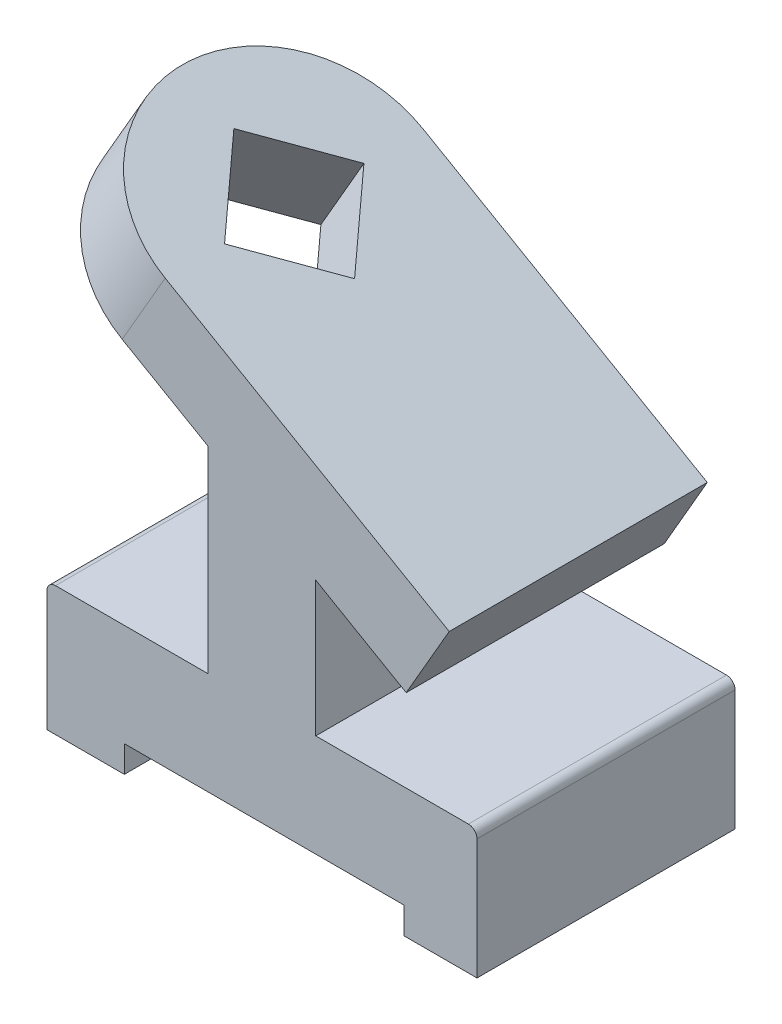
ISO-10303-21;
HEADER;
FILE_DESCRIPTION(('STEP AP214'),'2;1');
FILE_NAME('part.step','',(''),(''),'','','');
FILE_SCHEMA(('AUTOMOTIVE_DESIGN { 1 0 10303 214 1 1 1 1 }'));
ENDSEC;
DATA;
#1=APPLICATION_CONTEXT('core data for automotive mechanical design processes');
#2=APPLICATION_PROTOCOL_DEFINITION('international standard','automotive_design',2000,#1);
#3=PRODUCT_CONTEXT('',#1,'mechanical');
#4=PRODUCT('Part','Part','',(#3));
#5=PRODUCT_RELATED_PRODUCT_CATEGORY('part','',(#4));
#6=PRODUCT_DEFINITION_FORMATION('','',#4);
#7=PRODUCT_DEFINITION_CONTEXT('part definition',#1,'design');
#8=PRODUCT_DEFINITION('design','',#6,#7);
#9=PRODUCT_DEFINITION_SHAPE('','',#8);
#10=(LENGTH_UNIT() NAMED_UNIT(*) SI_UNIT(.MILLI.,.METRE.));
#11=(NAMED_UNIT(*) PLANE_ANGLE_UNIT() SI_UNIT($,.RADIAN.));
#12=(NAMED_UNIT(*) SI_UNIT($,.STERADIAN.) SOLID_ANGLE_UNIT());
#13=UNCERTAINTY_MEASURE_WITH_UNIT(LENGTH_MEASURE(1.E-05),#10,'distance_accuracy_value','');
#14=(GEOMETRIC_REPRESENTATION_CONTEXT(3) GLOBAL_UNCERTAINTY_ASSIGNED_CONTEXT((#13)) GLOBAL_UNIT_ASSIGNED_CONTEXT((#10,
#11,#12)) REPRESENTATION_CONTEXT('',''));
#15=CARTESIAN_POINT('',(0.,0.,0.));
#16=DIRECTION('',(0.,0.,1.));
#17=DIRECTION('',(1.,0.,0.));
#18=AXIS2_PLACEMENT_3D('',#15,#16,#17);
#19=CARTESIAN_POINT('',(-55.8324862973111,72.8306968374165,-38.1));
#20=DIRECTION('',(-0.5,-0.866025403784439,0.));
#21=DIRECTION('',(0.866025403784439,-0.5,0.));
#22=AXIS2_PLACEMENT_3D('',#19,#20,#21);
#23=PLANE('',#22);
#24=DIRECTION('',(0.,0.,1.));
#25=VECTOR('',#24,1.);
#26=CARTESIAN_POINT('',(-30.4324862973111,58.166,-38.1));
#27=LINE('',#26,#25);
#28=CARTESIAN_POINT('',(-30.432486297311,58.166,-38.1));
#29=VERTEX_POINT('',#28);
#30=CARTESIAN_POINT('',(-30.432486297311,58.166,38.1));
#31=VERTEX_POINT('',#30);
#32=EDGE_CURVE('E317',#29,#31,#27,.T.);
#33=ORIENTED_EDGE('',*,*,#32,.T.);
#34=DIRECTION('',(0.866025403784439,-0.5,0.));
#35=VECTOR('',#34,1.);
#36=CARTESIAN_POINT('',(-55.8324862973111,72.8306968374165,38.1));
#37=LINE('',#36,#35);
#38=CARTESIAN_POINT('',(-55.8324862973111,72.8306968374166,38.1));
#39=VERTEX_POINT('',#38);
#40=EDGE_CURVE('E216',#39,#31,#37,.T.);
#41=ORIENTED_EDGE('',*,*,#40,.F.);
#42=CARTESIAN_POINT('',(-55.8324862973111,72.8306968374166,0.));
#43=DIRECTION('',(0.5,0.866025403784439,0.));
#44=DIRECTION('',(-0.866025403784439,0.5,0.));
#45=AXIS2_PLACEMENT_3D('',#42,#43,#44);
#46=CIRCLE('',#45,38.1);
#47=CARTESIAN_POINT('',(-55.8324862973111,72.8306968374166,-38.1));
#48=VERTEX_POINT('',#47);
#49=EDGE_CURVE('E208',#48,#39,#46,.T.);
#50=ORIENTED_EDGE('',*,*,#49,.F.);
#51=DIRECTION('',(0.866025403784439,-0.5,0.));
#52=VECTOR('',#51,1.);
#53=CARTESIAN_POINT('',(-55.8324862973111,72.8306968374165,-38.1));
#54=LINE('',#53,#52);
#55=EDGE_CURVE('E222',#48,#29,#54,.T.);
#56=ORIENTED_EDGE('',*,*,#55,.T.);
#57=EDGE_LOOP('',(#33,#41,#50,#56));
#58=FACE_BOUND('',#57,.T.);
#59=DIRECTION('',(-0.612372435695794,0.353553390593273,-0.707106781186548));
#60=VECTOR('',#59,1.);
#61=CARTESIAN_POINT('',(-38.01487963985,62.5436968374166,0.));
#62=LINE('',#61,#60);
#63=CARTESIAN_POINT('',(-38.01487963985,62.5436968374166,0.));
#64=VERTEX_POINT('',#63);
#65=CARTESIAN_POINT('',(-55.8324862973111,72.8306968374165,-20.574));
#66=VERTEX_POINT('',#65);
#67=EDGE_CURVE('E199',#64,#66,#62,.T.);
#68=ORIENTED_EDGE('',*,*,#67,.T.);
#69=DIRECTION('',(-0.612372435695795,0.353553390593274,0.707106781186547));
#70=VECTOR('',#69,1.);
#71=CARTESIAN_POINT('',(-55.8324862973111,72.8306968374166,-20.574));
#72=LINE('',#71,#70);
#73=CARTESIAN_POINT('',(-73.6500929547721,83.1176968374166,0.));
#74=VERTEX_POINT('',#73);
#75=EDGE_CURVE('E48',#66,#74,#72,.T.);
#76=ORIENTED_EDGE('',*,*,#75,.T.);
#77=DIRECTION('',(0.612372435695795,-0.353553390593274,0.707106781186547));
#78=VECTOR('',#77,1.);
#79=CARTESIAN_POINT('',(-73.6500929547721,83.1176968374166,0.));
#80=LINE('',#79,#78);
#81=CARTESIAN_POINT('',(-55.8324862973111,72.8306968374166,20.574));
#82=VERTEX_POINT('',#81);
#83=EDGE_CURVE('E190',#74,#82,#80,.T.);
#84=ORIENTED_EDGE('',*,*,#83,.T.);
#85=DIRECTION('',(0.612372435695794,-0.353553390593274,-0.707106781186548));
#86=VECTOR('',#85,1.);
#87=CARTESIAN_POINT('',(-55.8324862973111,72.8306968374166,20.574));
#88=LINE('',#87,#86);
#89=EDGE_CURVE('E196',#82,#64,#88,.T.);
#90=ORIENTED_EDGE('',*,*,#89,.T.);
#91=EDGE_LOOP('',(#68,#76,#84,#90));
#92=FACE_BOUND('',#91,.T.);
#93=ADVANCED_FACE('F33',(#58,#92),#23,.T.);
#94=CARTESIAN_POINT('',(-43.1324862973111,94.8277420935413,-38.1));
#95=DIRECTION('',(0.5,0.866025403784439,0.));
#96=DIRECTION('',(-0.866025403784439,0.5,0.));
#97=AXIS2_PLACEMENT_3D('',#94,#95,#96);
#98=PLANE('',#97);
#99=DIRECTION('',(-0.866025403784439,0.5,0.));
#100=VECTOR('',#99,1.);
#101=CARTESIAN_POINT('',(-43.1324862973111,94.8277420935413,-38.1));
#102=LINE('',#101,#100);
#103=CARTESIAN_POINT('',(40.7312487416645,46.4089920935413,-38.1));
#104=VERTEX_POINT('',#103);
#105=CARTESIAN_POINT('',(-43.1324862973111,94.8277420935413,-38.1));
#106=VERTEX_POINT('',#105);
#107=EDGE_CURVE('E215',#104,#106,#102,.T.);
#108=ORIENTED_EDGE('',*,*,#107,.T.);
#109=CARTESIAN_POINT('',(-43.1324862973111,94.8277420935413,0.));
#110=DIRECTION('',(0.5,0.866025403784439,0.));
#111=DIRECTION('',(-0.866025403784439,0.5,0.));
#112=AXIS2_PLACEMENT_3D('',#109,#110,#111);
#113=CIRCLE('',#112,38.1);
#114=CARTESIAN_POINT('',(-43.1324862973111,94.8277420935413,38.1));
#115=VERTEX_POINT('',#114);
#116=EDGE_CURVE('E186',#106,#115,#113,.T.);
#117=ORIENTED_EDGE('',*,*,#116,.T.);
#118=DIRECTION('',(-0.866025403784439,0.5,0.));
#119=VECTOR('',#118,1.);
#120=CARTESIAN_POINT('',(-43.1324862973111,94.8277420935413,38.1));
#121=LINE('',#120,#119);
#122=CARTESIAN_POINT('',(40.7312487416645,46.4089920935413,38.1));
#123=VERTEX_POINT('',#122);
#124=EDGE_CURVE('E227',#123,#115,#121,.T.);
#125=ORIENTED_EDGE('',*,*,#124,.F.);
#126=DIRECTION('',(0.,0.,1.));
#127=VECTOR('',#126,1.);
#128=CARTESIAN_POINT('',(40.7312487416645,46.4089920935413,-38.1));
#129=LINE('',#128,#127);
#130=EDGE_CURVE('E224',#104,#123,#129,.T.);
#131=ORIENTED_EDGE('',*,*,#130,.F.);
#132=EDGE_LOOP('',(#108,#117,#125,#131));
#133=FACE_BOUND('',#132,.T.);
#134=DIRECTION('',(-0.612372435695795,0.353553390593274,-0.707106781186547));
#135=VECTOR('',#134,1.);
#136=CARTESIAN_POINT('',(-68.5390735681352,109.496242093541,-8.76299999999999));
#137=LINE('',#136,#135);
#138=CARTESIAN_POINT('',(-43.1324862973111,94.8277420935413,20.574));
#139=VERTEX_POINT('',#138);
#140=CARTESIAN_POINT('',(-60.9500929547721,105.114742093541,0.));
#141=VERTEX_POINT('',#140);
#142=EDGE_CURVE('E41',#139,#141,#137,.T.);
#143=ORIENTED_EDGE('',*,*,#142,.T.);
#144=DIRECTION('',(0.612372435695795,-0.353553390593274,-0.707106781186547));
#145=VECTOR('',#144,1.);
#146=CARTESIAN_POINT('',(-35.5435056839481,90.4462420935413,-29.337));
#147=LINE('',#146,#145);
#148=CARTESIAN_POINT('',(-43.1324862973111,94.8277420935413,-20.574));
#149=VERTEX_POINT('',#148);
#150=EDGE_CURVE('E11',#141,#149,#147,.T.);
#151=ORIENTED_EDGE('',*,*,#150,.T.);
#152=DIRECTION('',(0.612372435695794,-0.353553390593273,0.707106781186548));
#153=VECTOR('',#152,1.);
#154=CARTESIAN_POINT('',(-50.7214669106741,99.2092420935413,-29.337));
#155=LINE('',#154,#153);
#156=CARTESIAN_POINT('',(-25.3148796398501,84.5407420935413,0.));
#157=VERTEX_POINT('',#156);
#158=EDGE_CURVE('E342',#149,#157,#155,.T.);
#159=ORIENTED_EDGE('',*,*,#158,.T.);
#160=DIRECTION('',(-0.612372435695794,0.353553390593273,0.707106781186548));
#161=VECTOR('',#160,1.);
#162=CARTESIAN_POINT('',(-17.725899026487,80.1592420935413,-8.76300000000004));
#163=LINE('',#162,#161);
#164=EDGE_CURVE('E345',#157,#139,#163,.T.);
#165=ORIENTED_EDGE('',*,*,#164,.T.);
#166=EDGE_LOOP('',(#143,#151,#159,#165));
#167=FACE_BOUND('',#166,.T.);
#168=ADVANCED_FACE('F348',(#133,#167),#98,.T.);
#169=CARTESIAN_POINT('',(27.3525137026889,-30.2363051563377,-38.1));
#170=DIRECTION('',(-1.,0.,0.));
#171=DIRECTION('',(0.,-1.,0.));
#172=AXIS2_PLACEMENT_3D('',#169,#170,#171);
#173=PLANE('',#172);
#174=DIRECTION('',(0.,0.,1.));
#175=VECTOR('',#174,1.);
#176=CARTESIAN_POINT('',(27.3525137026889,-38.1,-38.1));
#177=LINE('',#176,#175);
#178=CARTESIAN_POINT('',(27.3525137026889,-38.1,-38.1));
#179=VERTEX_POINT('',#178);
#180=CARTESIAN_POINT('',(27.3525137026889,-38.1,38.1));
#181=VERTEX_POINT('',#180);
#182=EDGE_CURVE('E304',#179,#181,#177,.T.);
#183=ORIENTED_EDGE('',*,*,#182,.T.);
#184=DIRECTION('',(0.,-1.,0.));
#185=VECTOR('',#184,1.);
#186=CARTESIAN_POINT('',(27.3525137026889,-30.2363051563377,38.1));
#187=LINE('',#186,#185);
#188=CARTESIAN_POINT('',(27.3525137026889,-30.2363051563377,38.1));
#189=VERTEX_POINT('',#188);
#190=EDGE_CURVE('E242',#189,#181,#187,.T.);
#191=ORIENTED_EDGE('',*,*,#190,.F.);
#192=DIRECTION('',(0.,0.,1.));
#193=VECTOR('',#192,1.);
#194=CARTESIAN_POINT('',(27.3525137026889,-30.2363051563377,-38.1));
#195=LINE('',#194,#193);
#196=CARTESIAN_POINT('',(27.3525137026889,-30.2363051563377,-38.1));
#197=VERTEX_POINT('',#196);
#198=EDGE_CURVE('E305',#197,#189,#195,.T.);
#199=ORIENTED_EDGE('',*,*,#198,.F.);
#200=DIRECTION('',(0.,-1.,0.));
#201=VECTOR('',#200,1.);
#202=CARTESIAN_POINT('',(27.3525137026889,-30.2363051563377,-38.1));
#203=LINE('',#202,#201);
#204=EDGE_CURVE('E273',#197,#179,#203,.T.);
#205=ORIENTED_EDGE('',*,*,#204,.T.);
#206=EDGE_LOOP('',(#183,#191,#199,#205));
#207=FACE_BOUND('',#206,.T.);
#208=ADVANCED_FACE('F366',(#207),#173,.T.);
#209=CARTESIAN_POINT('',(-55.1974862973111,-30.2363051563377,-38.1));
#210=DIRECTION('',(0.,-1.,0.));
#211=DIRECTION('',(0.,0.,-1.));
#212=AXIS2_PLACEMENT_3D('',#209,#210,#211);
#213=PLANE('',#212);
#214=ORIENTED_EDGE('',*,*,#198,.T.);
#215=DIRECTION('',(1.,0.,0.));
#216=VECTOR('',#215,1.);
#217=CARTESIAN_POINT('',(-55.1974862973111,-30.2363051563377,38.1));
#218=LINE('',#217,#216);
#219=CARTESIAN_POINT('',(-55.1974862973111,-30.2363051563377,38.1));
#220=VERTEX_POINT('',#219);
#221=EDGE_CURVE('E270',#220,#189,#218,.T.);
#222=ORIENTED_EDGE('',*,*,#221,.F.);
#223=DIRECTION('',(0.,0.,1.));
#224=VECTOR('',#223,1.);
#225=CARTESIAN_POINT('',(-55.1974862973111,-30.2363051563377,-38.1));
#226=LINE('',#225,#224);
#227=CARTESIAN_POINT('',(-55.1974862973111,-30.2363051563377,-38.1));
#228=VERTEX_POINT('',#227);
#229=EDGE_CURVE('E308',#228,#220,#226,.T.);
#230=ORIENTED_EDGE('',*,*,#229,.F.);
#231=DIRECTION('',(1.,0.,0.));
#232=VECTOR('',#231,1.);
#233=CARTESIAN_POINT('',(-55.1974862973111,-30.2363051563377,-38.1));
#234=LINE('',#233,#232);
#235=EDGE_CURVE('E301',#228,#197,#234,.T.);
#236=ORIENTED_EDGE('',*,*,#235,.T.);
#237=EDGE_LOOP('',(#214,#222,#230,#236));
#238=FACE_BOUND('',#237,.T.);
#239=ADVANCED_FACE('F437',(#238),#213,.T.);
#240=CARTESIAN_POINT('',(-55.1974862973111,-38.1,-38.1));
#241=DIRECTION('',(1.,0.,0.));
#242=DIRECTION('',(0.,0.,-1.));
#243=AXIS2_PLACEMENT_3D('',#240,#241,#242);
#244=PLANE('',#243);
#245=ORIENTED_EDGE('',*,*,#229,.T.);
#246=DIRECTION('',(0.,1.,0.));
#247=VECTOR('',#246,1.);
#248=CARTESIAN_POINT('',(-55.1974862973111,-38.1,38.1));
#249=LINE('',#248,#247);
#250=CARTESIAN_POINT('',(-55.1974862973111,-38.1,38.1));
#251=VERTEX_POINT('',#250);
#252=EDGE_CURVE('E267',#251,#220,#249,.T.);
#253=ORIENTED_EDGE('',*,*,#252,.F.);
#254=DIRECTION('',(0.,0.,1.));
#255=VECTOR('',#254,1.);
#256=CARTESIAN_POINT('',(-55.1974862973111,-38.1,-38.1));
#257=LINE('',#256,#255);
#258=CARTESIAN_POINT('',(-55.1974862973111,-38.1,-38.1));
#259=VERTEX_POINT('',#258);
#260=EDGE_CURVE('E310',#259,#251,#257,.T.);
#261=ORIENTED_EDGE('',*,*,#260,.F.);
#262=DIRECTION('',(0.,1.,0.));
#263=VECTOR('',#262,1.);
#264=CARTESIAN_POINT('',(-55.1974862973111,-38.1,-38.1));
#265=LINE('',#264,#263);
#266=EDGE_CURVE('E298',#259,#228,#265,.T.);
#267=ORIENTED_EDGE('',*,*,#266,.T.);
#268=EDGE_LOOP('',(#245,#253,#261,#267));
#269=FACE_BOUND('',#268,.T.);
#270=ADVANCED_FACE('F433',(#269),#244,.T.);
#271=CARTESIAN_POINT('',(-78.0574862973111,-38.1,-38.1));
#272=DIRECTION('',(0.,-1.,0.));
#273=DIRECTION('',(1.,0.,0.));
#274=AXIS2_PLACEMENT_3D('',#271,#272,#273);
#275=PLANE('',#274);
#276=ORIENTED_EDGE('',*,*,#260,.T.);
#277=DIRECTION('',(1.,0.,0.));
#278=VECTOR('',#277,1.);
#279=CARTESIAN_POINT('',(-78.0574862973111,-38.1,38.1));
#280=LINE('',#279,#278);
#281=CARTESIAN_POINT('',(-78.0574862973111,-38.1,38.1));
#282=VERTEX_POINT('',#281);
#283=EDGE_CURVE('E264',#282,#251,#280,.T.);
#284=ORIENTED_EDGE('',*,*,#283,.F.);
#285=DIRECTION('',(0.,0.,1.));
#286=VECTOR('',#285,1.);
#287=CARTESIAN_POINT('',(-78.0574862973111,-38.1,-38.1));
#288=LINE('',#287,#286);
#289=CARTESIAN_POINT('',(-78.0574862973111,-38.1,-38.1));
#290=VERTEX_POINT('',#289);
#291=EDGE_CURVE('E312',#290,#282,#288,.T.);
#292=ORIENTED_EDGE('',*,*,#291,.F.);
#293=DIRECTION('',(1.,0.,0.));
#294=VECTOR('',#293,1.);
#295=CARTESIAN_POINT('',(-78.0574862973111,-38.1,-38.1));
#296=LINE('',#295,#294);
#297=EDGE_CURVE('E295',#290,#259,#296,.T.);
#298=ORIENTED_EDGE('',*,*,#297,.T.);
#299=EDGE_LOOP('',(#276,#284,#292,#298));
#300=FACE_BOUND('',#299,.T.);
#301=ADVANCED_FACE('F429',(#300),#275,.T.);
#302=CARTESIAN_POINT('',(-78.0574862973111,0.,-38.1));
#303=DIRECTION('',(-1.,0.,0.));
#304=DIRECTION('',(0.,0.,1.));
#305=AXIS2_PLACEMENT_3D('',#302,#303,#304);
#306=PLANE('',#305);
#307=DIRECTION('',(0.,-1.,0.));
#308=VECTOR('',#307,1.);
#309=CARTESIAN_POINT('',(-78.0574862973111,0.,38.1));
#310=LINE('',#309,#308);
#311=CARTESIAN_POINT('',(-78.0574862973111,-2.54,38.1));
#312=VERTEX_POINT('',#311);
#313=EDGE_CURVE('E262',#312,#282,#310,.T.);
#314=ORIENTED_EDGE('',*,*,#313,.F.);
#315=DIRECTION('',(0.,0.,1.));
#316=VECTOR('',#315,1.);
#317=CARTESIAN_POINT('',(-78.0574862973111,-2.54,-38.1));
#318=LINE('',#317,#316);
#319=CARTESIAN_POINT('',(-78.0574862973111,-2.54,-38.1));
#320=VERTEX_POINT('',#319);
#321=EDGE_CURVE('E338',#312,#320,#318,.F.);
#322=ORIENTED_EDGE('',*,*,#321,.T.);
#323=DIRECTION('',(0.,-1.,0.));
#324=VECTOR('',#323,1.);
#325=CARTESIAN_POINT('',(-78.0574862973111,0.,-38.1));
#326=LINE('',#325,#324);
#327=EDGE_CURVE('E293',#320,#290,#326,.T.);
#328=ORIENTED_EDGE('',*,*,#327,.T.);
#329=ORIENTED_EDGE('',*,*,#291,.T.);
#330=EDGE_LOOP('',(#314,#322,#328,#329));
#331=FACE_BOUND('',#330,.T.);
#332=ADVANCED_FACE('F423',(#331),#306,.T.);
#333=CARTESIAN_POINT('',(-78.0574862973111,0.,-38.1));
#334=DIRECTION('',(0.,1.,0.));
#335=DIRECTION('',(0.,0.,1.));
#336=AXIS2_PLACEMENT_3D('',#333,#334,#335);
#337=PLANE('',#336);
#338=DIRECTION('',(-1.,0.,0.));
#339=VECTOR('',#338,1.);
#340=CARTESIAN_POINT('',(-78.0574862973111,0.,-38.1));
#341=LINE('',#340,#339);
#342=CARTESIAN_POINT('',(-30.4324862973111,0.,-38.1));
#343=VERTEX_POINT('',#342);
#344=CARTESIAN_POINT('',(-75.5174862973111,0.,-38.1));
#345=VERTEX_POINT('',#344);
#346=EDGE_CURVE('E290',#343,#345,#341,.T.);
#347=ORIENTED_EDGE('',*,*,#346,.T.);
#348=DIRECTION('',(0.,0.,1.));
#349=VECTOR('',#348,1.);
#350=CARTESIAN_POINT('',(-75.5174862973111,0.,-38.1));
#351=LINE('',#350,#349);
#352=CARTESIAN_POINT('',(-75.5174862973111,0.,38.1));
#353=VERTEX_POINT('',#352);
#354=EDGE_CURVE('E333',#345,#353,#351,.T.);
#355=ORIENTED_EDGE('',*,*,#354,.T.);
#356=DIRECTION('',(-1.,0.,0.));
#357=VECTOR('',#356,1.);
#358=CARTESIAN_POINT('',(-78.0574862973111,0.,38.1));
#359=LINE('',#358,#357);
#360=CARTESIAN_POINT('',(-30.4324862973111,0.,38.1));
#361=VERTEX_POINT('',#360);
#362=EDGE_CURVE('E259',#361,#353,#359,.T.);
#363=ORIENTED_EDGE('',*,*,#362,.F.);
#364=DIRECTION('',(0.,0.,1.));
#365=VECTOR('',#364,1.);
#366=CARTESIAN_POINT('',(-30.4324862973111,0.,-38.1));
#367=LINE('',#366,#365);
#368=EDGE_CURVE('E315',#343,#361,#367,.T.);
#369=ORIENTED_EDGE('',*,*,#368,.F.);
#370=EDGE_LOOP('',(#347,#355,#363,#369));
#371=FACE_BOUND('',#370,.T.);
#372=ADVANCED_FACE('F416',(#371),#337,.T.);
#373=CARTESIAN_POINT('',(-30.4324862973111,0.,-38.1));
#374=DIRECTION('',(-1.,0.,0.));
#375=DIRECTION('',(0.,0.,1.));
#376=AXIS2_PLACEMENT_3D('',#373,#374,#375);
#377=PLANE('',#376);
#378=ORIENTED_EDGE('',*,*,#368,.T.);
#379=DIRECTION('',(0.,-1.,0.));
#380=VECTOR('',#379,1.);
#381=CARTESIAN_POINT('',(-30.4324862973111,0.,38.1));
#382=LINE('',#381,#380);
#383=EDGE_CURVE('E256',#31,#361,#382,.T.);
#384=ORIENTED_EDGE('',*,*,#383,.F.);
#385=ORIENTED_EDGE('',*,*,#32,.F.);
#386=DIRECTION('',(0.,-1.,0.));
#387=VECTOR('',#386,1.);
#388=CARTESIAN_POINT('',(-30.4324862973111,0.,-38.1));
#389=LINE('',#388,#387);
#390=EDGE_CURVE('E287',#29,#343,#389,.T.);
#391=ORIENTED_EDGE('',*,*,#390,.T.);
#392=EDGE_LOOP('',(#378,#384,#385,#391));
#393=FACE_BOUND('',#392,.T.);
#394=ADVANCED_FACE('F412',(#393),#377,.T.);
#395=CARTESIAN_POINT('',(1.3175137026889,58.166,-38.1));
#396=DIRECTION('',(1.,0.,0.));
#397=DIRECTION('',(0.,1.,0.));
#398=AXIS2_PLACEMENT_3D('',#395,#396,#397);
#399=PLANE('',#398);
#400=DIRECTION('',(0.,0.,-1.));
#401=VECTOR('',#400,1.);
#402=CARTESIAN_POINT('',(1.3175137026889,39.8351289532294,-38.1));
#403=LINE('',#402,#401);
#404=CARTESIAN_POINT('',(1.31751370268889,39.8351289532295,38.1));
#405=VERTEX_POINT('',#404);
#406=CARTESIAN_POINT('',(1.31751370268889,39.8351289532295,-38.1));
#407=VERTEX_POINT('',#406);
#408=EDGE_CURVE('E239',#405,#407,#403,.T.);
#409=ORIENTED_EDGE('',*,*,#408,.F.);
#410=DIRECTION('',(0.,1.,0.));
#411=VECTOR('',#410,1.);
#412=CARTESIAN_POINT('',(1.3175137026889,58.166,38.1));
#413=LINE('',#412,#411);
#414=CARTESIAN_POINT('',(1.3175137026889,0.,38.1));
#415=VERTEX_POINT('',#414);
#416=EDGE_CURVE('E253',#415,#405,#413,.T.);
#417=ORIENTED_EDGE('',*,*,#416,.F.);
#418=DIRECTION('',(0.,0.,1.));
#419=VECTOR('',#418,1.);
#420=CARTESIAN_POINT('',(1.3175137026889,0.,-38.1));
#421=LINE('',#420,#419);
#422=CARTESIAN_POINT('',(1.3175137026889,0.,-38.1));
#423=VERTEX_POINT('',#422);
#424=EDGE_CURVE('E319',#423,#415,#421,.T.);
#425=ORIENTED_EDGE('',*,*,#424,.F.);
#426=DIRECTION('',(0.,1.,0.));
#427=VECTOR('',#426,1.);
#428=CARTESIAN_POINT('',(1.3175137026889,58.166,-38.1));
#429=LINE('',#428,#427);
#430=EDGE_CURVE('E284',#423,#407,#429,.T.);
#431=ORIENTED_EDGE('',*,*,#430,.T.);
#432=EDGE_LOOP('',(#409,#417,#425,#431));
#433=FACE_BOUND('',#432,.T.);
#434=ADVANCED_FACE('F388',(#433),#399,.T.);
#435=CARTESIAN_POINT('',(1.3175137026889,0.,-38.1));
#436=DIRECTION('',(0.,1.,0.));
#437=DIRECTION('',(0.,0.,1.));
#438=AXIS2_PLACEMENT_3D('',#435,#436,#437);
#439=PLANE('',#438);
#440=DIRECTION('',(-1.,0.,0.));
#441=VECTOR('',#440,1.);
#442=CARTESIAN_POINT('',(1.3175137026889,0.,38.1));
#443=LINE('',#442,#441);
#444=CARTESIAN_POINT('',(46.4025137026889,0.,38.1));
#445=VERTEX_POINT('',#444);
#446=EDGE_CURVE('E251',#445,#415,#443,.T.);
#447=ORIENTED_EDGE('',*,*,#446,.F.);
#448=DIRECTION('',(0.,0.,1.));
#449=VECTOR('',#448,1.);
#450=CARTESIAN_POINT('',(46.4025137026889,0.,-38.1));
#451=LINE('',#450,#449);
#452=CARTESIAN_POINT('',(46.4025137026889,0.,-38.1));
#453=VERTEX_POINT('',#452);
#454=EDGE_CURVE('E329',#445,#453,#451,.F.);
#455=ORIENTED_EDGE('',*,*,#454,.T.);
#456=DIRECTION('',(-1.,0.,0.));
#457=VECTOR('',#456,1.);
#458=CARTESIAN_POINT('',(1.3175137026889,0.,-38.1));
#459=LINE('',#458,#457);
#460=EDGE_CURVE('E282',#453,#423,#459,.T.);
#461=ORIENTED_EDGE('',*,*,#460,.T.);
#462=ORIENTED_EDGE('',*,*,#424,.T.);
#463=EDGE_LOOP('',(#447,#455,#461,#462));
#464=FACE_BOUND('',#463,.T.);
#465=ADVANCED_FACE('F395',(#464),#439,.T.);
#466=CARTESIAN_POINT('',(48.9425137026889,0.,-38.1));
#467=DIRECTION('',(1.,0.,0.));
#468=DIRECTION('',(0.,1.,0.));
#469=AXIS2_PLACEMENT_3D('',#466,#467,#468);
#470=PLANE('',#469);
#471=DIRECTION('',(0.,1.,0.));
#472=VECTOR('',#471,1.);
#473=CARTESIAN_POINT('',(48.9425137026889,0.,-38.1));
#474=LINE('',#473,#472);
#475=CARTESIAN_POINT('',(48.9425137026889,-38.1,-38.1));
#476=VERTEX_POINT('',#475);
#477=CARTESIAN_POINT('',(48.9425137026889,-2.54,-38.1));
#478=VERTEX_POINT('',#477);
#479=EDGE_CURVE('E279',#476,#478,#474,.T.);
#480=ORIENTED_EDGE('',*,*,#479,.T.);
#481=DIRECTION('',(0.,0.,1.));
#482=VECTOR('',#481,1.);
#483=CARTESIAN_POINT('',(48.9425137026889,-2.54,-38.1));
#484=LINE('',#483,#482);
#485=CARTESIAN_POINT('',(48.9425137026889,-2.54,38.1));
#486=VERTEX_POINT('',#485);
#487=EDGE_CURVE('E307',#478,#486,#484,.T.);
#488=ORIENTED_EDGE('',*,*,#487,.T.);
#489=DIRECTION('',(0.,1.,0.));
#490=VECTOR('',#489,1.);
#491=CARTESIAN_POINT('',(48.9425137026889,0.,38.1));
#492=LINE('',#491,#490);
#493=CARTESIAN_POINT('',(48.9425137026889,-38.1,38.1));
#494=VERTEX_POINT('',#493);
#495=EDGE_CURVE('E248',#494,#486,#492,.T.);
#496=ORIENTED_EDGE('',*,*,#495,.F.);
#497=DIRECTION('',(0.,0.,1.));
#498=VECTOR('',#497,1.);
#499=CARTESIAN_POINT('',(48.9425137026889,-38.1,-38.1));
#500=LINE('',#499,#498);
#501=EDGE_CURVE('E322',#476,#494,#500,.T.);
#502=ORIENTED_EDGE('',*,*,#501,.F.);
#503=EDGE_LOOP('',(#480,#488,#496,#502));
#504=FACE_BOUND('',#503,.T.);
#505=ADVANCED_FACE('F447',(#504),#470,.T.);
#506=CARTESIAN_POINT('',(27.3525137026889,-38.1,-38.1));
#507=DIRECTION('',(0.,-1.,0.));
#508=DIRECTION('',(1.,0.,0.));
#509=AXIS2_PLACEMENT_3D('',#506,#507,#508);
#510=PLANE('',#509);
#511=ORIENTED_EDGE('',*,*,#501,.T.);
#512=DIRECTION('',(1.,0.,0.));
#513=VECTOR('',#512,1.);
#514=CARTESIAN_POINT('',(27.3525137026889,-38.1,38.1));
#515=LINE('',#514,#513);
#516=EDGE_CURVE('E245',#181,#494,#515,.T.);
#517=ORIENTED_EDGE('',*,*,#516,.F.);
#518=ORIENTED_EDGE('',*,*,#182,.F.);
#519=DIRECTION('',(1.,0.,0.));
#520=VECTOR('',#519,1.);
#521=CARTESIAN_POINT('',(27.3525137026889,-38.1,-38.1));
#522=LINE('',#521,#520);
#523=EDGE_CURVE('E276',#179,#476,#522,.T.);
#524=ORIENTED_EDGE('',*,*,#523,.T.);
#525=EDGE_LOOP('',(#511,#517,#518,#524));
#526=FACE_BOUND('',#525,.T.);
#527=ADVANCED_FACE('F444',(#526),#510,.T.);
#528=CARTESIAN_POINT('',(0.,0.,-38.1));
#529=DIRECTION('',(0.,0.,1.));
#530=DIRECTION('',(1.,0.,0.));
#531=AXIS2_PLACEMENT_3D('',#528,#529,#530);
#532=PLANE('',#531);
#533=ORIENTED_EDGE('',*,*,#390,.F.);
#534=ORIENTED_EDGE('',*,*,#55,.F.);
#535=DIRECTION('',(-0.5,-0.866025403784439,0.));
#536=VECTOR('',#535,1.);
#537=CARTESIAN_POINT('',(-55.8324862973111,72.8306968374165,-38.1));
#538=LINE('',#537,#536);
#539=EDGE_CURVE('E219',#106,#48,#538,.T.);
#540=ORIENTED_EDGE('',*,*,#539,.F.);
#541=ORIENTED_EDGE('',*,*,#107,.F.);
#542=DIRECTION('',(0.5,0.866025403784439,0.));
#543=VECTOR('',#542,1.);
#544=CARTESIAN_POINT('',(40.7312487416645,46.4089920935413,-38.1));
#545=LINE('',#544,#543);
#546=CARTESIAN_POINT('',(28.0312487416645,24.4119468374165,-38.1));
#547=VERTEX_POINT('',#546);
#548=EDGE_CURVE('E212',#547,#104,#545,.T.);
#549=ORIENTED_EDGE('',*,*,#548,.F.);
#550=EDGE_CURVE('E221',#407,#547,#54,.T.);
#551=ORIENTED_EDGE('',*,*,#550,.F.);
#552=ORIENTED_EDGE('',*,*,#430,.F.);
#553=ORIENTED_EDGE('',*,*,#460,.F.);
#554=CARTESIAN_POINT('',(46.4025137026889,-2.54,-38.1));
#555=DIRECTION('',(0.,0.,1.));
#556=DIRECTION('',(1.,0.,0.));
#557=AXIS2_PLACEMENT_3D('',#554,#555,#556);
#558=CIRCLE('',#557,2.54);
#559=EDGE_CURVE('E331',#453,#478,#558,.F.);
#560=ORIENTED_EDGE('',*,*,#559,.T.);
#561=ORIENTED_EDGE('',*,*,#479,.F.);
#562=ORIENTED_EDGE('',*,*,#523,.F.);
#563=ORIENTED_EDGE('',*,*,#204,.F.);
#564=ORIENTED_EDGE('',*,*,#235,.F.);
#565=ORIENTED_EDGE('',*,*,#266,.F.);
#566=ORIENTED_EDGE('',*,*,#297,.F.);
#567=ORIENTED_EDGE('',*,*,#327,.F.);
#568=CARTESIAN_POINT('',(-75.5174862973111,-2.54,-38.1));
#569=DIRECTION('',(0.,0.,1.));
#570=DIRECTION('',(1.,0.,0.));
#571=AXIS2_PLACEMENT_3D('',#568,#569,#570);
#572=CIRCLE('',#571,2.54);
#573=EDGE_CURVE('E340',#320,#345,#572,.F.);
#574=ORIENTED_EDGE('',*,*,#573,.T.);
#575=ORIENTED_EDGE('',*,*,#346,.F.);
#576=EDGE_LOOP('',(#533,#534,#540,#541,#549,#551,#552,#553,#560,#561,#562,#563,#564,#565,#566,
#567,#574,#575));
#577=FACE_BOUND('',#576,.T.);
#578=ADVANCED_FACE('F399',(#577),#532,.F.);
#579=CARTESIAN_POINT('',(0.,0.,38.1));
#580=DIRECTION('',(0.,0.,1.));
#581=DIRECTION('',(1.,0.,0.));
#582=AXIS2_PLACEMENT_3D('',#579,#580,#581);
#583=PLANE('',#582);
#584=ORIENTED_EDGE('',*,*,#40,.T.);
#585=ORIENTED_EDGE('',*,*,#383,.T.);
#586=ORIENTED_EDGE('',*,*,#362,.T.);
#587=CARTESIAN_POINT('',(-75.5174862973111,-2.54,38.1));
#588=DIRECTION('',(0.,0.,1.));
#589=DIRECTION('',(1.,0.,0.));
#590=AXIS2_PLACEMENT_3D('',#587,#588,#589);
#591=CIRCLE('',#590,2.54);
#592=EDGE_CURVE('E336',#353,#312,#591,.T.);
#593=ORIENTED_EDGE('',*,*,#592,.T.);
#594=ORIENTED_EDGE('',*,*,#313,.T.);
#595=ORIENTED_EDGE('',*,*,#283,.T.);
#596=ORIENTED_EDGE('',*,*,#252,.T.);
#597=ORIENTED_EDGE('',*,*,#221,.T.);
#598=ORIENTED_EDGE('',*,*,#190,.T.);
#599=ORIENTED_EDGE('',*,*,#516,.T.);
#600=ORIENTED_EDGE('',*,*,#495,.T.);
#601=CARTESIAN_POINT('',(46.4025137026889,-2.54,38.1));
#602=DIRECTION('',(0.,0.,1.));
#603=DIRECTION('',(1.,0.,0.));
#604=AXIS2_PLACEMENT_3D('',#601,#602,#603);
#605=CIRCLE('',#604,2.54);
#606=EDGE_CURVE('E327',#486,#445,#605,.T.);
#607=ORIENTED_EDGE('',*,*,#606,.T.);
#608=ORIENTED_EDGE('',*,*,#446,.T.);
#609=ORIENTED_EDGE('',*,*,#416,.T.);
#610=CARTESIAN_POINT('',(28.0312487416645,24.4119468374165,38.1));
#611=VERTEX_POINT('',#610);
#612=EDGE_CURVE('E233',#405,#611,#37,.T.);
#613=ORIENTED_EDGE('',*,*,#612,.T.);
#614=DIRECTION('',(0.5,0.866025403784439,0.));
#615=VECTOR('',#614,1.);
#616=CARTESIAN_POINT('',(40.7312487416645,46.4089920935413,38.1));
#617=LINE('',#616,#615);
#618=EDGE_CURVE('E210',#611,#123,#617,.T.);
#619=ORIENTED_EDGE('',*,*,#618,.T.);
#620=ORIENTED_EDGE('',*,*,#124,.T.);
#621=DIRECTION('',(-0.5,-0.866025403784439,0.));
#622=VECTOR('',#621,1.);
#623=CARTESIAN_POINT('',(-55.8324862973111,72.8306968374165,38.1));
#624=LINE('',#623,#622);
#625=EDGE_CURVE('E230',#115,#39,#624,.T.);
#626=ORIENTED_EDGE('',*,*,#625,.T.);
#627=EDGE_LOOP('',(#584,#585,#586,#593,#594,#595,#596,#597,#598,#599,#600,#607,#608,#609,#613,
#619,#620,#626));
#628=FACE_BOUND('',#627,.T.);
#629=ADVANCED_FACE('F391',(#628),#583,.T.);
#630=CARTESIAN_POINT('',(46.4025137026889,-2.54,-38.1));
#631=DIRECTION('',(0.,0.,1.));
#632=DIRECTION('',(1.,0.,0.));
#633=AXIS2_PLACEMENT_3D('',#630,#631,#632);
#634=CYLINDRICAL_SURFACE('',#633,2.54);
#635=ORIENTED_EDGE('',*,*,#559,.F.);
#636=ORIENTED_EDGE('',*,*,#454,.F.);
#637=ORIENTED_EDGE('',*,*,#606,.F.);
#638=ORIENTED_EDGE('',*,*,#487,.F.);
#639=EDGE_LOOP('',(#635,#636,#637,#638));
#640=FACE_BOUND('',#639,.T.);
#641=ADVANCED_FACE('F451',(#640),#634,.T.);
#642=CARTESIAN_POINT('',(-75.5174862973111,-2.54,-38.1));
#643=DIRECTION('',(0.,0.,1.));
#644=DIRECTION('',(1.,0.,0.));
#645=AXIS2_PLACEMENT_3D('',#642,#643,#644);
#646=CYLINDRICAL_SURFACE('',#645,2.54);
#647=ORIENTED_EDGE('',*,*,#573,.F.);
#648=ORIENTED_EDGE('',*,*,#321,.F.);
#649=ORIENTED_EDGE('',*,*,#592,.F.);
#650=ORIENTED_EDGE('',*,*,#354,.F.);
#651=EDGE_LOOP('',(#647,#648,#649,#650));
#652=FACE_BOUND('',#651,.T.);
#653=ADVANCED_FACE('F35',(#652),#646,.T.);
#654=CARTESIAN_POINT('',(40.7312487416645,46.4089920935413,-38.1));
#655=DIRECTION('',(0.866025403784439,-0.5,0.));
#656=DIRECTION('',(0.5,0.866025403784439,0.));
#657=AXIS2_PLACEMENT_3D('',#654,#655,#656);
#658=PLANE('',#657);
#659=ORIENTED_EDGE('',*,*,#618,.F.);
#660=DIRECTION('',(0.,0.,1.));
#661=VECTOR('',#660,1.);
#662=CARTESIAN_POINT('',(28.0312487416645,24.4119468374165,-38.1));
#663=LINE('',#662,#661);
#664=EDGE_CURVE('E236',#547,#611,#663,.T.);
#665=ORIENTED_EDGE('',*,*,#664,.F.);
#666=ORIENTED_EDGE('',*,*,#548,.T.);
#667=ORIENTED_EDGE('',*,*,#130,.T.);
#668=EDGE_LOOP('',(#659,#665,#666,#667));
#669=FACE_BOUND('',#668,.T.);
#670=ADVANCED_FACE('F372',(#669),#658,.T.);
#671=ORIENTED_EDGE('',*,*,#612,.F.);
#672=ORIENTED_EDGE('',*,*,#408,.T.);
#673=ORIENTED_EDGE('',*,*,#550,.T.);
#674=ORIENTED_EDGE('',*,*,#664,.T.);
#675=EDGE_LOOP('',(#671,#672,#673,#674));
#676=FACE_BOUND('',#675,.T.);
#677=ADVANCED_FACE('F361',(#676),#23,.T.);
#678=CARTESIAN_POINT('',(-55.8324862973111,72.8306968374166,0.));
#679=DIRECTION('',(0.5,0.866025403784439,0.));
#680=DIRECTION('',(-0.866025403784439,0.5,0.));
#681=AXIS2_PLACEMENT_3D('',#678,#679,#680);
#682=CYLINDRICAL_SURFACE('',#681,38.1);
#683=ORIENTED_EDGE('',*,*,#49,.T.);
#684=ORIENTED_EDGE('',*,*,#625,.F.);
#685=ORIENTED_EDGE('',*,*,#116,.F.);
#686=ORIENTED_EDGE('',*,*,#539,.T.);
#687=EDGE_LOOP('',(#683,#684,#685,#686));
#688=FACE_BOUND('',#687,.T.);
#689=ADVANCED_FACE('F371',(#688),#682,.T.);
#690=CARTESIAN_POINT('',(-11.8648443262643,148.984886620267,-20.574));
#691=DIRECTION('',(0.612372435695794,-0.353553390593274,0.707106781186548));
#692=DIRECTION('',(0.755928946018455,0.,-0.654653670707977));
#693=AXIS2_PLACEMENT_3D('',#690,#691,#692);
#694=PLANE('',#693);
#695=DIRECTION('',(-0.5,-0.866025403784439,0.));
#696=VECTOR('',#695,1.);
#697=CARTESIAN_POINT('',(-29.6824509837253,159.271886620267,0.));
#698=LINE('',#697,#696);
#699=EDGE_CURVE('E181',#141,#74,#698,.T.);
#700=ORIENTED_EDGE('',*,*,#699,.T.);
#701=ORIENTED_EDGE('',*,*,#75,.F.);
#702=DIRECTION('',(-0.5,-0.866025403784439,0.));
#703=VECTOR('',#702,1.);
#704=CARTESIAN_POINT('',(-11.8648443262643,148.984886620267,-20.574));
#705=LINE('',#704,#703);
#706=EDGE_CURVE('E204',#149,#66,#705,.T.);
#707=ORIENTED_EDGE('',*,*,#706,.F.);
#708=ORIENTED_EDGE('',*,*,#150,.F.);
#709=EDGE_LOOP('',(#700,#701,#707,#708));
#710=FACE_BOUND('',#709,.T.);
#711=ADVANCED_FACE('F183',(#710),#694,.T.);
#712=CARTESIAN_POINT('',(-29.6824509837253,159.271886620267,0.));
#713=DIRECTION('',(0.612372435695794,-0.353553390593274,-0.707106781186548));
#714=DIRECTION('',(-0.755928946018455,0.,-0.654653670707977));
#715=AXIS2_PLACEMENT_3D('',#712,#713,#714);
#716=PLANE('',#715);
#717=DIRECTION('',(-0.5,-0.866025403784439,0.));
#718=VECTOR('',#717,1.);
#719=CARTESIAN_POINT('',(-11.8648443262643,148.984886620267,20.574));
#720=LINE('',#719,#718);
#721=EDGE_CURVE('E187',#139,#82,#720,.T.);
#722=ORIENTED_EDGE('',*,*,#721,.T.);
#723=ORIENTED_EDGE('',*,*,#83,.F.);
#724=ORIENTED_EDGE('',*,*,#699,.F.);
#725=ORIENTED_EDGE('',*,*,#142,.F.);
#726=EDGE_LOOP('',(#722,#723,#724,#725));
#727=FACE_BOUND('',#726,.T.);
#728=ADVANCED_FACE('F191',(#727),#716,.T.);
#729=CARTESIAN_POINT('',(-11.8648443262643,148.984886620267,20.574));
#730=DIRECTION('',(-0.612372435695795,0.353553390593274,-0.707106781186547));
#731=DIRECTION('',(-0.755928946018454,0.,0.654653670707978));
#732=AXIS2_PLACEMENT_3D('',#729,#730,#731);
#733=PLANE('',#732);
#734=DIRECTION('',(-0.5,-0.866025403784439,0.));
#735=VECTOR('',#734,1.);
#736=CARTESIAN_POINT('',(5.95276233119674,138.697886620267,0.));
#737=LINE('',#736,#735);
#738=EDGE_CURVE('E56',#157,#64,#737,.T.);
#739=ORIENTED_EDGE('',*,*,#738,.T.);
#740=ORIENTED_EDGE('',*,*,#89,.F.);
#741=ORIENTED_EDGE('',*,*,#721,.F.);
#742=ORIENTED_EDGE('',*,*,#164,.F.);
#743=EDGE_LOOP('',(#739,#740,#741,#742));
#744=FACE_BOUND('',#743,.T.);
#745=ADVANCED_FACE('F350',(#744),#733,.T.);
#746=CARTESIAN_POINT('',(5.95276233119674,138.697886620267,0.));
#747=DIRECTION('',(-0.612372435695795,0.353553390593274,0.707106781186547));
#748=DIRECTION('',(0.755928946018454,0.,0.654653670707978));
#749=AXIS2_PLACEMENT_3D('',#746,#747,#748);
#750=PLANE('',#749);
#751=ORIENTED_EDGE('',*,*,#706,.T.);
#752=ORIENTED_EDGE('',*,*,#67,.F.);
#753=ORIENTED_EDGE('',*,*,#738,.F.);
#754=ORIENTED_EDGE('',*,*,#158,.F.);
#755=EDGE_LOOP('',(#751,#752,#753,#754));
#756=FACE_BOUND('',#755,.T.);
#757=ADVANCED_FACE('F351',(#756),#750,.T.);
#758=CLOSED_SHELL('',(#93,#168,#208,#239,#270,#301,#332,#372,#394,#434,#465,#505,#527,#578,#629,
#641,#653,#670,#677,#689,#711,#728,#745,#757));
#759=MANIFOLD_SOLID_BREP('B2',#758);
#760=ADVANCED_BREP_SHAPE_REPRESENTATION('',(#18,#759),#14);
#761=SHAPE_DEFINITION_REPRESENTATION(#9,#760);
ENDSEC;
END-ISO-10303-21;
